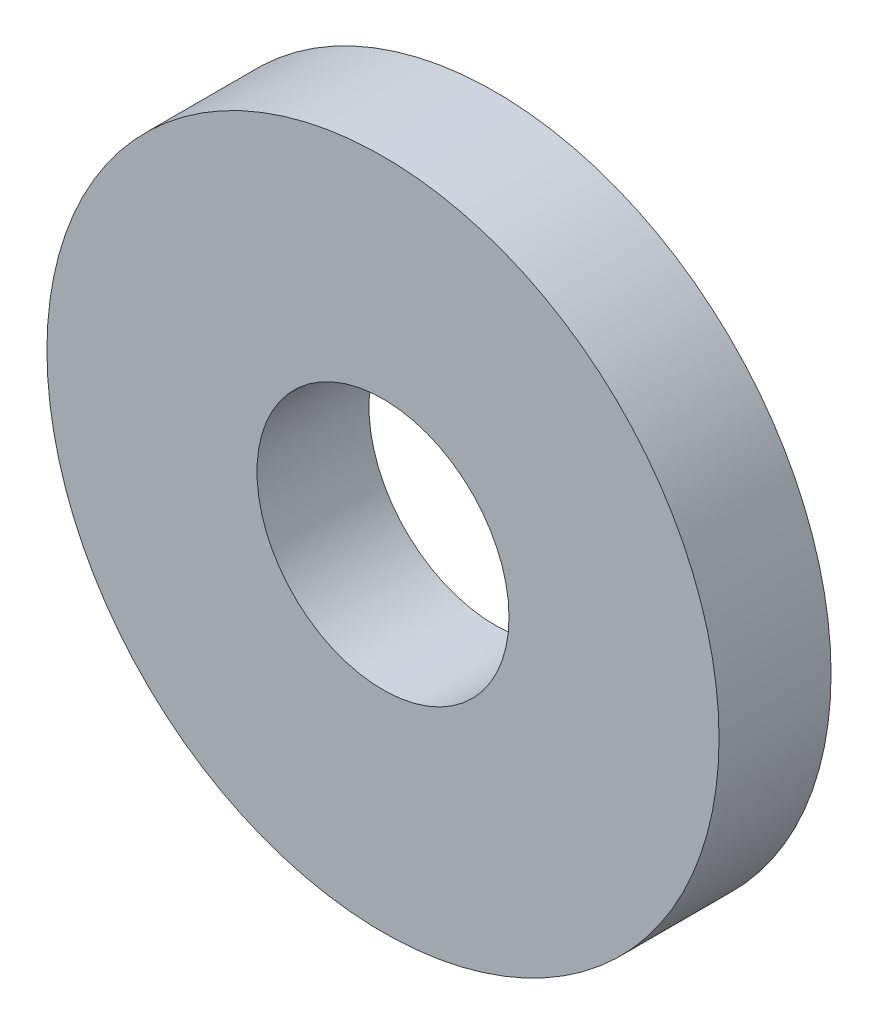
ISO-10303-21;
HEADER;
FILE_DESCRIPTION(('STEP AP214'),'2;1');
FILE_NAME('part.step','',(''),(''),'','','');
FILE_SCHEMA(('AUTOMOTIVE_DESIGN { 1 0 10303 214 1 1 1 1 }'));
ENDSEC;
DATA;
#1=APPLICATION_CONTEXT('core data for automotive mechanical design processes');
#2=APPLICATION_PROTOCOL_DEFINITION('international standard','automotive_design',2000,#1);
#3=PRODUCT_CONTEXT('',#1,'mechanical');
#4=PRODUCT('Part','Part','',(#3));
#5=PRODUCT_RELATED_PRODUCT_CATEGORY('part','',(#4));
#6=PRODUCT_DEFINITION_FORMATION('','',#4);
#7=PRODUCT_DEFINITION_CONTEXT('part definition',#1,'design');
#8=PRODUCT_DEFINITION('design','',#6,#7);
#9=PRODUCT_DEFINITION_SHAPE('','',#8);
#10=(LENGTH_UNIT() NAMED_UNIT(*) SI_UNIT(.MILLI.,.METRE.));
#11=(NAMED_UNIT(*) PLANE_ANGLE_UNIT() SI_UNIT($,.RADIAN.));
#12=(NAMED_UNIT(*) SI_UNIT($,.STERADIAN.) SOLID_ANGLE_UNIT());
#13=UNCERTAINTY_MEASURE_WITH_UNIT(LENGTH_MEASURE(1.E-05),#10,'distance_accuracy_value','');
#14=(GEOMETRIC_REPRESENTATION_CONTEXT(3) GLOBAL_UNCERTAINTY_ASSIGNED_CONTEXT((#13)) GLOBAL_UNIT_ASSIGNED_CONTEXT((#10,
#11,#12)) REPRESENTATION_CONTEXT('',''));
#15=CARTESIAN_POINT('',(0.,0.,0.));
#16=DIRECTION('',(0.,0.,1.));
#17=DIRECTION('',(1.,0.,0.));
#18=AXIS2_PLACEMENT_3D('',#15,#16,#17);
#19=CARTESIAN_POINT('',(0.,0.,2.));
#20=DIRECTION('',(0.,0.,1.));
#21=DIRECTION('',(1.,0.,0.));
#22=AXIS2_PLACEMENT_3D('',#19,#20,#21);
#23=PLANE('',#22);
#24=CARTESIAN_POINT('',(0.,0.,2.));
#25=DIRECTION('',(0.,0.,1.));
#26=DIRECTION('',(1.,0.,0.));
#27=AXIS2_PLACEMENT_3D('',#24,#25,#26);
#28=CIRCLE('',#27,6.);
#29=CARTESIAN_POINT('',(6.,0.,2.));
#30=VERTEX_POINT('',#29);
#31=EDGE_CURVE('E10',#30,#30,#28,.T.);
#32=ORIENTED_EDGE('',*,*,#31,.T.);
#33=EDGE_LOOP('',(#32));
#34=FACE_BOUND('',#33,.T.);
#35=CARTESIAN_POINT('',(0.,0.,2.));
#36=DIRECTION('',(0.,0.,1.));
#37=DIRECTION('',(1.,0.,0.));
#38=AXIS2_PLACEMENT_3D('',#35,#36,#37);
#39=CIRCLE('',#38,2.25);
#40=CARTESIAN_POINT('',(2.25,0.,2.));
#41=VERTEX_POINT('',#40);
#42=EDGE_CURVE('E48',#41,#41,#39,.T.);
#43=ORIENTED_EDGE('',*,*,#42,.F.);
#44=EDGE_LOOP('',(#43));
#45=FACE_BOUND('',#44,.T.);
#46=ADVANCED_FACE('F37',(#34,#45),#23,.T.);
#47=CARTESIAN_POINT('',(0.,0.,0.));
#48=DIRECTION('',(0.,0.,1.));
#49=DIRECTION('',(1.,0.,0.));
#50=AXIS2_PLACEMENT_3D('',#47,#48,#49);
#51=PLANE('',#50);
#52=CARTESIAN_POINT('',(0.,0.,0.));
#53=DIRECTION('',(0.,0.,1.));
#54=DIRECTION('',(1.,0.,0.));
#55=AXIS2_PLACEMENT_3D('',#52,#53,#54);
#56=CIRCLE('',#55,6.);
#57=CARTESIAN_POINT('',(6.,0.,0.));
#58=VERTEX_POINT('',#57);
#59=EDGE_CURVE('E41',#58,#58,#56,.T.);
#60=ORIENTED_EDGE('',*,*,#59,.F.);
#61=EDGE_LOOP('',(#60));
#62=FACE_BOUND('',#61,.T.);
#63=CARTESIAN_POINT('',(0.,0.,0.));
#64=DIRECTION('',(0.,0.,1.));
#65=DIRECTION('',(1.,0.,0.));
#66=AXIS2_PLACEMENT_3D('',#63,#64,#65);
#67=CIRCLE('',#66,2.25);
#68=CARTESIAN_POINT('',(2.25,0.,0.));
#69=VERTEX_POINT('',#68);
#70=EDGE_CURVE('E50',#69,#69,#67,.T.);
#71=ORIENTED_EDGE('',*,*,#70,.T.);
#72=EDGE_LOOP('',(#71));
#73=FACE_BOUND('',#72,.T.);
#74=ADVANCED_FACE('F60',(#62,#73),#51,.F.);
#75=CARTESIAN_POINT('',(0.,0.,2.));
#76=DIRECTION('',(0.,0.,-1.));
#77=DIRECTION('',(-1.,0.,0.));
#78=AXIS2_PLACEMENT_3D('',#75,#76,#77);
#79=CYLINDRICAL_SURFACE('',#78,6.);
#80=ORIENTED_EDGE('',*,*,#31,.F.);
#81=EDGE_LOOP('',(#80));
#82=FACE_BOUND('',#81,.T.);
#83=ORIENTED_EDGE('',*,*,#59,.T.);
#84=EDGE_LOOP('',(#83));
#85=FACE_BOUND('',#84,.T.);
#86=ADVANCED_FACE('F39',(#82,#85),#79,.T.);
#87=CARTESIAN_POINT('',(0.,0.,2.));
#88=DIRECTION('',(0.,0.,-1.));
#89=DIRECTION('',(-1.,0.,0.));
#90=AXIS2_PLACEMENT_3D('',#87,#88,#89);
#91=CYLINDRICAL_SURFACE('',#90,2.25);
#92=ORIENTED_EDGE('',*,*,#42,.T.);
#93=EDGE_LOOP('',(#92));
#94=FACE_BOUND('',#93,.T.);
#95=ORIENTED_EDGE('',*,*,#70,.F.);
#96=EDGE_LOOP('',(#95));
#97=FACE_BOUND('',#96,.T.);
#98=ADVANCED_FACE('F56',(#94,#97),#91,.F.);
#99=CLOSED_SHELL('',(#46,#74,#86,#98));
#100=MANIFOLD_SOLID_BREP('B2',#99);
#101=ADVANCED_BREP_SHAPE_REPRESENTATION('',(#18,#100),#14);
#102=SHAPE_DEFINITION_REPRESENTATION(#9,#101);
ENDSEC;
END-ISO-10303-21;
